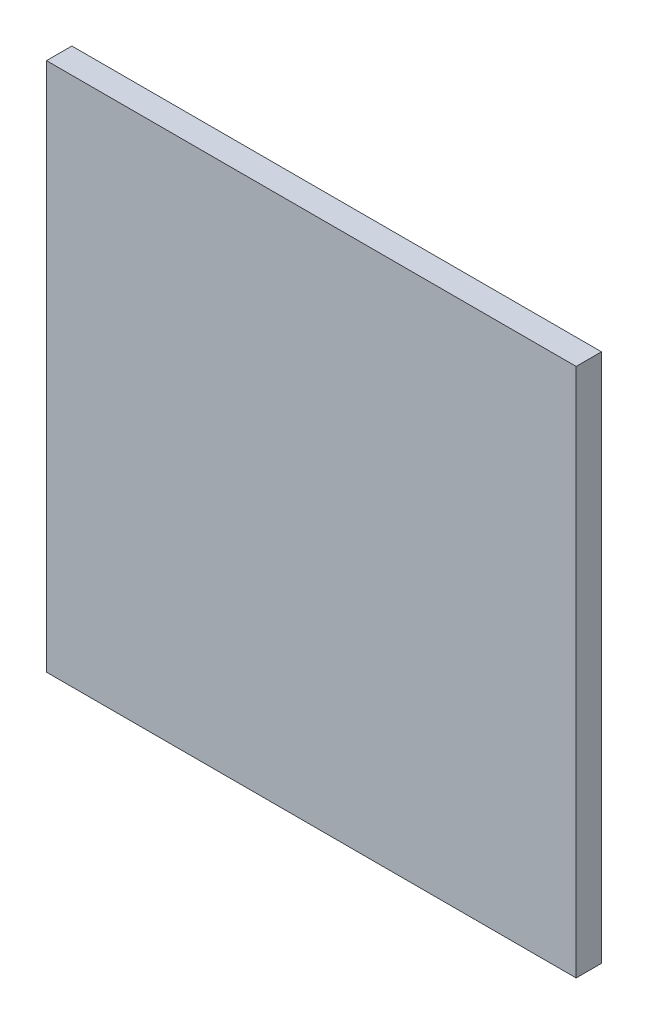
ISO-10303-21;
HEADER;
FILE_DESCRIPTION(('STEP AP214'),'2;1');
FILE_NAME('part.step','',(''),(''),'','','');
FILE_SCHEMA(('AUTOMOTIVE_DESIGN { 1 0 10303 214 1 1 1 1 }'));
ENDSEC;
DATA;
#1=APPLICATION_CONTEXT('core data for automotive mechanical design processes');
#2=APPLICATION_PROTOCOL_DEFINITION('international standard','automotive_design',2000,#1);
#3=PRODUCT_CONTEXT('',#1,'mechanical');
#4=PRODUCT('Part','Part','',(#3));
#5=PRODUCT_RELATED_PRODUCT_CATEGORY('part','',(#4));
#6=PRODUCT_DEFINITION_FORMATION('','',#4);
#7=PRODUCT_DEFINITION_CONTEXT('part definition',#1,'design');
#8=PRODUCT_DEFINITION('design','',#6,#7);
#9=PRODUCT_DEFINITION_SHAPE('','',#8);
#10=(LENGTH_UNIT() NAMED_UNIT(*) SI_UNIT(.MILLI.,.METRE.));
#11=(NAMED_UNIT(*) PLANE_ANGLE_UNIT() SI_UNIT($,.RADIAN.));
#12=(NAMED_UNIT(*) SI_UNIT($,.STERADIAN.) SOLID_ANGLE_UNIT());
#13=UNCERTAINTY_MEASURE_WITH_UNIT(LENGTH_MEASURE(1.E-05),#10,'distance_accuracy_value','');
#14=(GEOMETRIC_REPRESENTATION_CONTEXT(3) GLOBAL_UNCERTAINTY_ASSIGNED_CONTEXT((#13)) GLOBAL_UNIT_ASSIGNED_CONTEXT((#10,
#11,#12)) REPRESENTATION_CONTEXT('',''));
#15=CARTESIAN_POINT('',(0.,0.,0.));
#16=DIRECTION('',(0.,0.,1.));
#17=DIRECTION('',(1.,0.,0.));
#18=AXIS2_PLACEMENT_3D('',#15,#16,#17);
#19=CARTESIAN_POINT('',(0.,0.,0.1));
#20=DIRECTION('',(0.,0.,1.));
#21=DIRECTION('',(1.,0.,0.));
#22=AXIS2_PLACEMENT_3D('',#19,#20,#21);
#23=PLANE('',#22);
#24=DIRECTION('',(0.,1.,0.));
#25=VECTOR('',#24,1.);
#26=CARTESIAN_POINT('',(0.,0.,0.1));
#27=LINE('',#26,#25);
#28=CARTESIAN_POINT('',(0.,0.,0.1));
#29=VERTEX_POINT('',#28);
#30=CARTESIAN_POINT('',(0.,2.09,0.1));
#31=VERTEX_POINT('',#30);
#32=EDGE_CURVE('E72',#29,#31,#27,.T.);
#33=ORIENTED_EDGE('',*,*,#32,.F.);
#34=DIRECTION('',(1.,0.,0.));
#35=VECTOR('',#34,1.);
#36=CARTESIAN_POINT('',(0.,0.,0.1));
#37=LINE('',#36,#35);
#38=CARTESIAN_POINT('',(2.09,0.,0.1));
#39=VERTEX_POINT('',#38);
#40=EDGE_CURVE('E67',#29,#39,#37,.T.);
#41=ORIENTED_EDGE('',*,*,#40,.T.);
#42=DIRECTION('',(0.,1.,0.));
#43=VECTOR('',#42,1.);
#44=CARTESIAN_POINT('',(2.09,0.,0.1));
#45=LINE('',#44,#43);
#46=CARTESIAN_POINT('',(2.09,2.09,0.1));
#47=VERTEX_POINT('',#46);
#48=EDGE_CURVE('E69',#39,#47,#45,.T.);
#49=ORIENTED_EDGE('',*,*,#48,.T.);
#50=DIRECTION('',(1.,0.,0.));
#51=VECTOR('',#50,1.);
#52=CARTESIAN_POINT('',(0.,2.09,0.1));
#53=LINE('',#52,#51);
#54=EDGE_CURVE('E11',#31,#47,#53,.T.);
#55=ORIENTED_EDGE('',*,*,#54,.F.);
#56=EDGE_LOOP('',(#33,#41,#49,#55));
#57=FACE_BOUND('',#56,.T.);
#58=ADVANCED_FACE('F17',(#57),#23,.T.);
#59=CARTESIAN_POINT('',(0.,0.,0.));
#60=DIRECTION('',(0.,0.,1.));
#61=DIRECTION('',(1.,0.,0.));
#62=AXIS2_PLACEMENT_3D('',#59,#60,#61);
#63=PLANE('',#62);
#64=DIRECTION('',(1.,0.,0.));
#65=VECTOR('',#64,1.);
#66=CARTESIAN_POINT('',(0.,2.09,0.));
#67=LINE('',#66,#65);
#68=CARTESIAN_POINT('',(0.,2.09,0.));
#69=VERTEX_POINT('',#68);
#70=CARTESIAN_POINT('',(2.09,2.09,0.));
#71=VERTEX_POINT('',#70);
#72=EDGE_CURVE('E28',#69,#71,#67,.T.);
#73=ORIENTED_EDGE('',*,*,#72,.T.);
#74=DIRECTION('',(0.,1.,0.));
#75=VECTOR('',#74,1.);
#76=CARTESIAN_POINT('',(2.09,0.,0.));
#77=LINE('',#76,#75);
#78=CARTESIAN_POINT('',(2.09,0.,0.));
#79=VERTEX_POINT('',#78);
#80=EDGE_CURVE('E90',#79,#71,#77,.T.);
#81=ORIENTED_EDGE('',*,*,#80,.F.);
#82=DIRECTION('',(1.,0.,0.));
#83=VECTOR('',#82,1.);
#84=CARTESIAN_POINT('',(0.,0.,0.));
#85=LINE('',#84,#83);
#86=CARTESIAN_POINT('',(0.,0.,0.));
#87=VERTEX_POINT('',#86);
#88=EDGE_CURVE('E21',#87,#79,#85,.T.);
#89=ORIENTED_EDGE('',*,*,#88,.F.);
#90=DIRECTION('',(0.,1.,0.));
#91=VECTOR('',#90,1.);
#92=CARTESIAN_POINT('',(0.,0.,0.));
#93=LINE('',#92,#91);
#94=EDGE_CURVE('E99',#87,#69,#93,.T.);
#95=ORIENTED_EDGE('',*,*,#94,.T.);
#96=EDGE_LOOP('',(#73,#81,#89,#95));
#97=FACE_BOUND('',#96,.T.);
#98=ADVANCED_FACE('F19',(#97),#63,.F.);
#99=CARTESIAN_POINT('',(0.,2.09,0.));
#100=DIRECTION('',(0.,1.,0.));
#101=DIRECTION('',(1.,0.,0.));
#102=AXIS2_PLACEMENT_3D('',#99,#100,#101);
#103=PLANE('',#102);
#104=ORIENTED_EDGE('',*,*,#72,.F.);
#105=DIRECTION('',(0.,0.,1.));
#106=VECTOR('',#105,1.);
#107=CARTESIAN_POINT('',(0.,2.09,0.));
#108=LINE('',#107,#106);
#109=EDGE_CURVE('E105',#69,#31,#108,.T.);
#110=ORIENTED_EDGE('',*,*,#109,.T.);
#111=ORIENTED_EDGE('',*,*,#54,.T.);
#112=DIRECTION('',(0.,0.,1.));
#113=VECTOR('',#112,1.);
#114=CARTESIAN_POINT('',(2.09,2.09,0.));
#115=LINE('',#114,#113);
#116=EDGE_CURVE('E84',#71,#47,#115,.T.);
#117=ORIENTED_EDGE('',*,*,#116,.F.);
#118=EDGE_LOOP('',(#104,#110,#111,#117));
#119=FACE_BOUND('',#118,.T.);
#120=ADVANCED_FACE('F139',(#119),#103,.T.);
#121=CARTESIAN_POINT('',(0.,0.,0.));
#122=DIRECTION('',(0.,1.,0.));
#123=DIRECTION('',(1.,0.,0.));
#124=AXIS2_PLACEMENT_3D('',#121,#122,#123);
#125=PLANE('',#124);
#126=DIRECTION('',(0.,0.,1.));
#127=VECTOR('',#126,1.);
#128=CARTESIAN_POINT('',(2.09,0.,0.));
#129=LINE('',#128,#127);
#130=EDGE_CURVE('E83',#79,#39,#129,.T.);
#131=ORIENTED_EDGE('',*,*,#130,.T.);
#132=ORIENTED_EDGE('',*,*,#40,.F.);
#133=DIRECTION('',(0.,0.,1.));
#134=VECTOR('',#133,1.);
#135=CARTESIAN_POINT('',(0.,0.,0.));
#136=LINE('',#135,#134);
#137=EDGE_CURVE('E91',#87,#29,#136,.T.);
#138=ORIENTED_EDGE('',*,*,#137,.F.);
#139=ORIENTED_EDGE('',*,*,#88,.T.);
#140=EDGE_LOOP('',(#131,#132,#138,#139));
#141=FACE_BOUND('',#140,.T.);
#142=ADVANCED_FACE('F87',(#141),#125,.F.);
#143=CARTESIAN_POINT('',(2.09,0.,0.));
#144=DIRECTION('',(1.,0.,0.));
#145=DIRECTION('',(0.,1.,0.));
#146=AXIS2_PLACEMENT_3D('',#143,#144,#145);
#147=PLANE('',#146);
#148=ORIENTED_EDGE('',*,*,#130,.F.);
#149=ORIENTED_EDGE('',*,*,#80,.T.);
#150=ORIENTED_EDGE('',*,*,#116,.T.);
#151=ORIENTED_EDGE('',*,*,#48,.F.);
#152=EDGE_LOOP('',(#148,#149,#150,#151));
#153=FACE_BOUND('',#152,.T.);
#154=ADVANCED_FACE('F81',(#153),#147,.T.);
#155=CARTESIAN_POINT('',(0.,0.,0.));
#156=DIRECTION('',(1.,0.,0.));
#157=DIRECTION('',(0.,1.,0.));
#158=AXIS2_PLACEMENT_3D('',#155,#156,#157);
#159=PLANE('',#158);
#160=ORIENTED_EDGE('',*,*,#32,.T.);
#161=ORIENTED_EDGE('',*,*,#109,.F.);
#162=ORIENTED_EDGE('',*,*,#94,.F.);
#163=ORIENTED_EDGE('',*,*,#137,.T.);
#164=EDGE_LOOP('',(#160,#161,#162,#163));
#165=FACE_BOUND('',#164,.T.);
#166=ADVANCED_FACE('F125',(#165),#159,.F.);
#167=CLOSED_SHELL('',(#58,#98,#120,#142,#154,#166));
#168=MANIFOLD_SOLID_BREP('B1',#167);
#169=ADVANCED_BREP_SHAPE_REPRESENTATION('',(#18,#168),#14);
#170=SHAPE_DEFINITION_REPRESENTATION(#9,#169);
ENDSEC;
END-ISO-10303-21;
